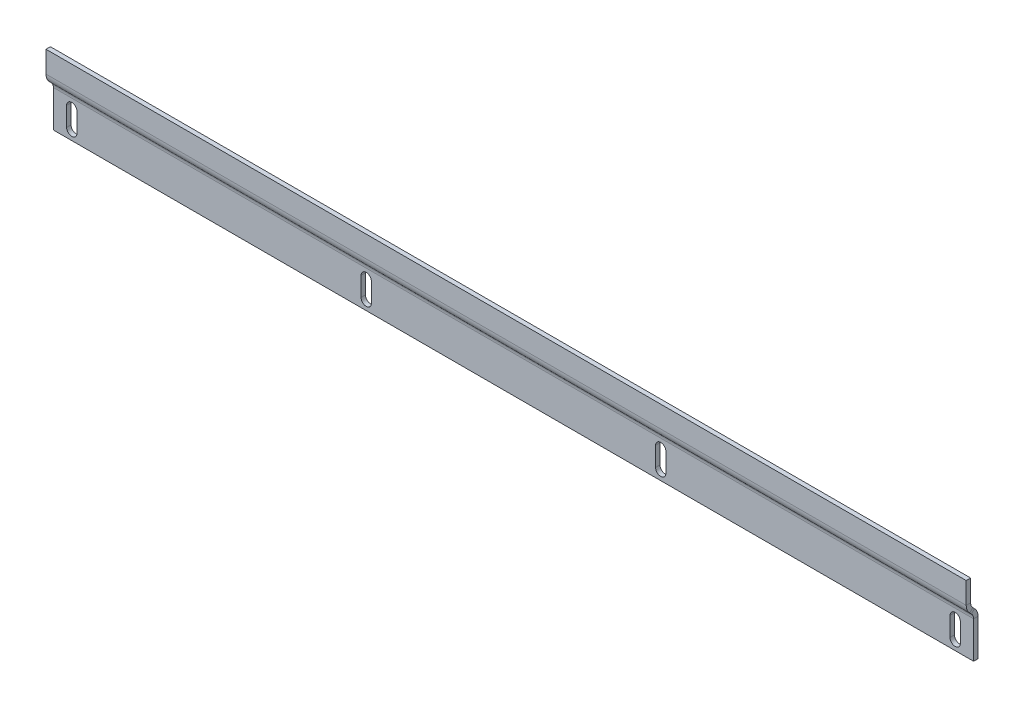
ISO-10303-21;
HEADER;
FILE_DESCRIPTION(('STEP AP214'),'2;1');
FILE_NAME('part.step','',(''),(''),'','','');
FILE_SCHEMA(('AUTOMOTIVE_DESIGN { 1 0 10303 214 1 1 1 1 }'));
ENDSEC;
DATA;
#1=APPLICATION_CONTEXT('core data for automotive mechanical design processes');
#2=APPLICATION_PROTOCOL_DEFINITION('international standard','automotive_design',2000,#1);
#3=PRODUCT_CONTEXT('',#1,'mechanical');
#4=PRODUCT('Part','Part','',(#3));
#5=PRODUCT_RELATED_PRODUCT_CATEGORY('part','',(#4));
#6=PRODUCT_DEFINITION_FORMATION('','',#4);
#7=PRODUCT_DEFINITION_CONTEXT('part definition',#1,'design');
#8=PRODUCT_DEFINITION('design','',#6,#7);
#9=PRODUCT_DEFINITION_SHAPE('','',#8);
#10=(LENGTH_UNIT() NAMED_UNIT(*) SI_UNIT(.MILLI.,.METRE.));
#11=(NAMED_UNIT(*) PLANE_ANGLE_UNIT() SI_UNIT($,.RADIAN.));
#12=(NAMED_UNIT(*) SI_UNIT($,.STERADIAN.) SOLID_ANGLE_UNIT());
#13=UNCERTAINTY_MEASURE_WITH_UNIT(LENGTH_MEASURE(1.E-05),#10,'distance_accuracy_value','');
#14=(GEOMETRIC_REPRESENTATION_CONTEXT(3) GLOBAL_UNCERTAINTY_ASSIGNED_CONTEXT((#13)) GLOBAL_UNIT_ASSIGNED_CONTEXT((#10,
#11,#12)) REPRESENTATION_CONTEXT('',''));
#15=CARTESIAN_POINT('',(0.,0.,0.));
#16=DIRECTION('',(0.,0.,1.));
#17=DIRECTION('',(1.,0.,0.));
#18=AXIS2_PLACEMENT_3D('',#15,#16,#17);
#19=CARTESIAN_POINT('',(300.,-6.00000000000003,0.));
#20=DIRECTION('',(0.,0.,-0.999999999999999));
#21=DIRECTION('',(-1.,0.,0.));
#22=AXIS2_PLACEMENT_3D('',#19,#20,#21);
#23=CYLINDRICAL_SURFACE('',#22,3.5);
#24=DIRECTION('',(0.,0.,0.999999999999999));
#25=VECTOR('',#24,1.);
#26=CARTESIAN_POINT('',(296.5,-6.00000000000006,0.));
#27=LINE('',#26,#25);
#28=CARTESIAN_POINT('',(296.5,-6.00000000000005,-3.));
#29=VERTEX_POINT('',#28);
#30=CARTESIAN_POINT('',(296.5,-6.00000000000006,0.));
#31=VERTEX_POINT('',#30);
#32=EDGE_CURVE('E11',#29,#31,#27,.T.);
#33=ORIENTED_EDGE('',*,*,#32,.F.);
#34=CARTESIAN_POINT('',(300.,-6.00000000000003,-2.99999999999999));
#35=DIRECTION('',(0.,0.,0.999999999999999));
#36=DIRECTION('',(1.,0.,0.));
#37=AXIS2_PLACEMENT_3D('',#34,#35,#36);
#38=CIRCLE('',#37,3.5);
#39=CARTESIAN_POINT('',(303.5,-6.00000000000002,-3.));
#40=VERTEX_POINT('',#39);
#41=EDGE_CURVE('E173',#40,#29,#38,.T.);
#42=ORIENTED_EDGE('',*,*,#41,.F.);
#43=DIRECTION('',(0.,0.,0.999999999999999));
#44=VECTOR('',#43,1.);
#45=CARTESIAN_POINT('',(303.5,-6.00000000000003,0.));
#46=LINE('',#45,#44);
#47=CARTESIAN_POINT('',(303.5,-6.00000000000003,0.));
#48=VERTEX_POINT('',#47);
#49=EDGE_CURVE('E53',#40,#48,#46,.T.);
#50=ORIENTED_EDGE('',*,*,#49,.T.);
#51=CARTESIAN_POINT('',(300.,-6.00000000000003,0.));
#52=DIRECTION('',(0.,0.,0.999999999999999));
#53=DIRECTION('',(1.,0.,0.));
#54=AXIS2_PLACEMENT_3D('',#51,#52,#53);
#55=CIRCLE('',#54,3.5);
#56=EDGE_CURVE('E270',#48,#31,#55,.T.);
#57=ORIENTED_EDGE('',*,*,#56,.T.);
#58=EDGE_LOOP('',(#33,#42,#50,#57));
#59=FACE_BOUND('',#58,.T.);
#60=ADVANCED_FACE('F43',(#59),#23,.F.);
#61=CARTESIAN_POINT('',(303.5,-19.,0.));
#62=DIRECTION('',(-1.,0.,0.));
#63=DIRECTION('',(0.,1.,0.));
#64=AXIS2_PLACEMENT_3D('',#61,#62,#63);
#65=PLANE('',#64);
#66=ORIENTED_EDGE('',*,*,#49,.F.);
#67=DIRECTION('',(0.,0.999999999999999,0.));
#68=VECTOR('',#67,1.);
#69=CARTESIAN_POINT('',(303.5,0.,-3.));
#70=LINE('',#69,#68);
#71=CARTESIAN_POINT('',(303.5,-19.,-3.));
#72=VERTEX_POINT('',#71);
#73=EDGE_CURVE('E190',#72,#40,#70,.T.);
#74=ORIENTED_EDGE('',*,*,#73,.F.);
#75=DIRECTION('',(0.,0.,0.999999999999999));
#76=VECTOR('',#75,1.);
#77=CARTESIAN_POINT('',(303.5,-19.,0.));
#78=LINE('',#77,#76);
#79=CARTESIAN_POINT('',(303.5,-19.,0.));
#80=VERTEX_POINT('',#79);
#81=EDGE_CURVE('E165',#72,#80,#78,.T.);
#82=ORIENTED_EDGE('',*,*,#81,.T.);
#83=DIRECTION('',(0.,1.,0.));
#84=VECTOR('',#83,1.);
#85=CARTESIAN_POINT('',(303.5,-19.,0.));
#86=LINE('',#85,#84);
#87=EDGE_CURVE('E278',#80,#48,#86,.T.);
#88=ORIENTED_EDGE('',*,*,#87,.T.);
#89=EDGE_LOOP('',(#66,#74,#82,#88));
#90=FACE_BOUND('',#89,.T.);
#91=ADVANCED_FACE('F281',(#90),#65,.T.);
#92=CARTESIAN_POINT('',(300.,-19.,0.));
#93=DIRECTION('',(0.,0.,-0.999999999999999));
#94=DIRECTION('',(-1.,0.,0.));
#95=AXIS2_PLACEMENT_3D('',#92,#93,#94);
#96=CYLINDRICAL_SURFACE('',#95,3.5);
#97=ORIENTED_EDGE('',*,*,#81,.F.);
#98=CARTESIAN_POINT('',(300.,-19.,-3.00000000000001));
#99=DIRECTION('',(0.,0.,0.999999999999999));
#100=DIRECTION('',(1.,0.,0.));
#101=AXIS2_PLACEMENT_3D('',#98,#99,#100);
#102=CIRCLE('',#101,3.5);
#103=CARTESIAN_POINT('',(296.5,-19.,-3.));
#104=VERTEX_POINT('',#103);
#105=EDGE_CURVE('E171',#104,#72,#102,.T.);
#106=ORIENTED_EDGE('',*,*,#105,.F.);
#107=DIRECTION('',(0.,0.,0.999999999999999));
#108=VECTOR('',#107,1.);
#109=CARTESIAN_POINT('',(296.5,-19.0000000000001,0.));
#110=LINE('',#109,#108);
#111=CARTESIAN_POINT('',(296.5,-19.0000000000001,0.));
#112=VERTEX_POINT('',#111);
#113=EDGE_CURVE('E47',#104,#112,#110,.T.);
#114=ORIENTED_EDGE('',*,*,#113,.T.);
#115=CARTESIAN_POINT('',(300.,-19.,0.));
#116=DIRECTION('',(0.,0.,0.999999999999999));
#117=DIRECTION('',(1.,0.,0.));
#118=AXIS2_PLACEMENT_3D('',#115,#116,#117);
#119=CIRCLE('',#118,3.5);
#120=EDGE_CURVE('E553',#112,#80,#119,.T.);
#121=ORIENTED_EDGE('',*,*,#120,.T.);
#122=EDGE_LOOP('',(#97,#106,#114,#121));
#123=FACE_BOUND('',#122,.T.);
#124=ADVANCED_FACE('F176',(#123),#96,.F.);
#125=CARTESIAN_POINT('',(100.,-6.00000000000003,0.));
#126=DIRECTION('',(0.,0.,-0.999999999999999));
#127=DIRECTION('',(-1.,0.,0.));
#128=AXIS2_PLACEMENT_3D('',#125,#126,#127);
#129=CYLINDRICAL_SURFACE('',#128,3.5);
#130=DIRECTION('',(0.,0.,0.999999999999999));
#131=VECTOR('',#130,1.);
#132=CARTESIAN_POINT('',(96.5000000000001,-6.00000000000006,0.));
#133=LINE('',#132,#131);
#134=CARTESIAN_POINT('',(96.5,-6.00000000000005,-3.));
#135=VERTEX_POINT('',#134);
#136=CARTESIAN_POINT('',(96.5000000000001,-6.00000000000006,0.));
#137=VERTEX_POINT('',#136);
#138=EDGE_CURVE('E166',#135,#137,#133,.T.);
#139=ORIENTED_EDGE('',*,*,#138,.F.);
#140=CARTESIAN_POINT('',(100.,-6.00000000000003,-2.99999999999998));
#141=DIRECTION('',(0.,0.,0.999999999999999));
#142=DIRECTION('',(1.,0.,0.));
#143=AXIS2_PLACEMENT_3D('',#140,#141,#142);
#144=CIRCLE('',#143,3.5);
#145=CARTESIAN_POINT('',(103.5,-6.00000000000002,-3.));
#146=VERTEX_POINT('',#145);
#147=EDGE_CURVE('E184',#146,#135,#144,.T.);
#148=ORIENTED_EDGE('',*,*,#147,.F.);
#149=DIRECTION('',(0.,0.,0.999999999999999));
#150=VECTOR('',#149,1.);
#151=CARTESIAN_POINT('',(103.5,-6.00000000000003,0.));
#152=LINE('',#151,#150);
#153=CARTESIAN_POINT('',(103.5,-6.00000000000003,0.));
#154=VERTEX_POINT('',#153);
#155=EDGE_CURVE('E258',#146,#154,#152,.T.);
#156=ORIENTED_EDGE('',*,*,#155,.T.);
#157=CARTESIAN_POINT('',(100.,-6.00000000000003,0.));
#158=DIRECTION('',(0.,0.,0.999999999999999));
#159=DIRECTION('',(1.,0.,0.));
#160=AXIS2_PLACEMENT_3D('',#157,#158,#159);
#161=CIRCLE('',#160,3.5);
#162=EDGE_CURVE('E547',#154,#137,#161,.T.);
#163=ORIENTED_EDGE('',*,*,#162,.T.);
#164=EDGE_LOOP('',(#139,#148,#156,#163));
#165=FACE_BOUND('',#164,.T.);
#166=ADVANCED_FACE('F580',(#165),#129,.F.);
#167=CARTESIAN_POINT('',(103.5,-19.,0.));
#168=DIRECTION('',(-1.,0.,0.));
#169=DIRECTION('',(0.,1.,0.));
#170=AXIS2_PLACEMENT_3D('',#167,#168,#169);
#171=PLANE('',#170);
#172=ORIENTED_EDGE('',*,*,#155,.F.);
#173=DIRECTION('',(0.,0.999999999999999,0.));
#174=VECTOR('',#173,1.);
#175=CARTESIAN_POINT('',(103.5,0.,-3.));
#176=LINE('',#175,#174);
#177=CARTESIAN_POINT('',(103.5,-19.,-3.));
#178=VERTEX_POINT('',#177);
#179=EDGE_CURVE('E179',#178,#146,#176,.T.);
#180=ORIENTED_EDGE('',*,*,#179,.F.);
#181=DIRECTION('',(0.,0.,0.999999999999999));
#182=VECTOR('',#181,1.);
#183=CARTESIAN_POINT('',(103.5,-19.,0.));
#184=LINE('',#183,#182);
#185=CARTESIAN_POINT('',(103.5,-19.,0.));
#186=VERTEX_POINT('',#185);
#187=EDGE_CURVE('E255',#178,#186,#184,.T.);
#188=ORIENTED_EDGE('',*,*,#187,.T.);
#189=DIRECTION('',(0.,1.,0.));
#190=VECTOR('',#189,1.);
#191=CARTESIAN_POINT('',(103.5,-19.,0.));
#192=LINE('',#191,#190);
#193=EDGE_CURVE('E439',#186,#154,#192,.T.);
#194=ORIENTED_EDGE('',*,*,#193,.T.);
#195=EDGE_LOOP('',(#172,#180,#188,#194));
#196=FACE_BOUND('',#195,.T.);
#197=ADVANCED_FACE('F437',(#196),#171,.T.);
#198=CARTESIAN_POINT('',(100.,-19.,0.));
#199=DIRECTION('',(0.,0.,-0.999999999999999));
#200=DIRECTION('',(-1.,0.,0.));
#201=AXIS2_PLACEMENT_3D('',#198,#199,#200);
#202=CYLINDRICAL_SURFACE('',#201,3.5);
#203=ORIENTED_EDGE('',*,*,#187,.F.);
#204=CARTESIAN_POINT('',(100.,-19.,-3.00000000000001));
#205=DIRECTION('',(0.,0.,0.999999999999999));
#206=DIRECTION('',(1.,0.,0.));
#207=AXIS2_PLACEMENT_3D('',#204,#205,#206);
#208=CIRCLE('',#207,3.5);
#209=CARTESIAN_POINT('',(96.5,-19.,-3.));
#210=VERTEX_POINT('',#209);
#211=EDGE_CURVE('E357',#210,#178,#208,.T.);
#212=ORIENTED_EDGE('',*,*,#211,.F.);
#213=DIRECTION('',(0.,0.,0.999999999999999));
#214=VECTOR('',#213,1.);
#215=CARTESIAN_POINT('',(96.5,-19.,0.));
#216=LINE('',#215,#214);
#217=CARTESIAN_POINT('',(96.5,-19.,0.));
#218=VERTEX_POINT('',#217);
#219=EDGE_CURVE('E252',#210,#218,#216,.T.);
#220=ORIENTED_EDGE('',*,*,#219,.T.);
#221=CARTESIAN_POINT('',(100.,-19.,0.));
#222=DIRECTION('',(0.,0.,0.999999999999999));
#223=DIRECTION('',(1.,0.,0.));
#224=AXIS2_PLACEMENT_3D('',#221,#222,#223);
#225=CIRCLE('',#224,3.5);
#226=EDGE_CURVE('E433',#218,#186,#225,.T.);
#227=ORIENTED_EDGE('',*,*,#226,.T.);
#228=EDGE_LOOP('',(#203,#212,#220,#227));
#229=FACE_BOUND('',#228,.T.);
#230=ADVANCED_FACE('F428',(#229),#202,.F.);
#231=CARTESIAN_POINT('',(-303.5,-19.,0.));
#232=DIRECTION('',(1.,0.,0.));
#233=DIRECTION('',(0.,-1.,0.));
#234=AXIS2_PLACEMENT_3D('',#231,#232,#233);
#235=PLANE('',#234);
#236=DIRECTION('',(0.,0.,0.999999999999999));
#237=VECTOR('',#236,1.);
#238=CARTESIAN_POINT('',(-303.5,-19.,0.));
#239=LINE('',#238,#237);
#240=CARTESIAN_POINT('',(-303.499999999999,-19.,-3.));
#241=VERTEX_POINT('',#240);
#242=CARTESIAN_POINT('',(-303.5,-19.,0.));
#243=VERTEX_POINT('',#242);
#244=EDGE_CURVE('E249',#241,#243,#239,.T.);
#245=ORIENTED_EDGE('',*,*,#244,.F.);
#246=DIRECTION('',(0.,0.999999999999999,0.));
#247=VECTOR('',#246,1.);
#248=CARTESIAN_POINT('',(-303.499999999999,0.,-3.));
#249=LINE('',#248,#247);
#250=CARTESIAN_POINT('',(-303.499999999999,-5.99999999999999,-3.));
#251=VERTEX_POINT('',#250);
#252=EDGE_CURVE('E406',#251,#241,#249,.F.);
#253=ORIENTED_EDGE('',*,*,#252,.F.);
#254=DIRECTION('',(0.,0.,0.999999999999999));
#255=VECTOR('',#254,1.);
#256=CARTESIAN_POINT('',(-303.5,-6.00000000000001,0.));
#257=LINE('',#256,#255);
#258=CARTESIAN_POINT('',(-303.5,-6.00000000000001,0.));
#259=VERTEX_POINT('',#258);
#260=EDGE_CURVE('E246',#251,#259,#257,.T.);
#261=ORIENTED_EDGE('',*,*,#260,.T.);
#262=DIRECTION('',(0.,-1.,0.));
#263=VECTOR('',#262,1.);
#264=CARTESIAN_POINT('',(-303.5,-19.,0.));
#265=LINE('',#264,#263);
#266=EDGE_CURVE('E517',#259,#243,#265,.T.);
#267=ORIENTED_EDGE('',*,*,#266,.T.);
#268=EDGE_LOOP('',(#245,#253,#261,#267));
#269=FACE_BOUND('',#268,.T.);
#270=ADVANCED_FACE('F683',(#269),#235,.T.);
#271=CARTESIAN_POINT('',(-300.,-6.00000000000003,0.));
#272=DIRECTION('',(0.,0.,-0.999999999999999));
#273=DIRECTION('',(-1.,0.,0.));
#274=AXIS2_PLACEMENT_3D('',#271,#272,#273);
#275=CYLINDRICAL_SURFACE('',#274,3.5);
#276=ORIENTED_EDGE('',*,*,#260,.F.);
#277=CARTESIAN_POINT('',(-300.,-6.00000000000003,-3.));
#278=DIRECTION('',(0.,0.,0.999999999999999));
#279=DIRECTION('',(1.,0.,0.));
#280=AXIS2_PLACEMENT_3D('',#277,#278,#279);
#281=CIRCLE('',#280,3.5);
#282=CARTESIAN_POINT('',(-296.499999999999,-5.99999999999999,-3.));
#283=VERTEX_POINT('',#282);
#284=EDGE_CURVE('E338',#283,#251,#281,.T.);
#285=ORIENTED_EDGE('',*,*,#284,.F.);
#286=DIRECTION('',(0.,0.,0.999999999999999));
#287=VECTOR('',#286,1.);
#288=CARTESIAN_POINT('',(-296.5,-6.00000000000001,0.));
#289=LINE('',#288,#287);
#290=CARTESIAN_POINT('',(-296.5,-6.00000000000001,0.));
#291=VERTEX_POINT('',#290);
#292=EDGE_CURVE('E243',#283,#291,#289,.T.);
#293=ORIENTED_EDGE('',*,*,#292,.T.);
#294=CARTESIAN_POINT('',(-300.,-6.00000000000003,0.));
#295=DIRECTION('',(0.,0.,0.999999999999999));
#296=DIRECTION('',(1.,0.,0.));
#297=AXIS2_PLACEMENT_3D('',#294,#295,#296);
#298=CIRCLE('',#297,3.5);
#299=EDGE_CURVE('E521',#291,#259,#298,.T.);
#300=ORIENTED_EDGE('',*,*,#299,.T.);
#301=EDGE_LOOP('',(#276,#285,#293,#300));
#302=FACE_BOUND('',#301,.T.);
#303=ADVANCED_FACE('F690',(#302),#275,.F.);
#304=CARTESIAN_POINT('',(-296.5,-19.,0.));
#305=DIRECTION('',(-1.,0.,0.));
#306=DIRECTION('',(0.,1.,0.));
#307=AXIS2_PLACEMENT_3D('',#304,#305,#306);
#308=PLANE('',#307);
#309=ORIENTED_EDGE('',*,*,#292,.F.);
#310=DIRECTION('',(0.,0.999999999999999,0.));
#311=VECTOR('',#310,1.);
#312=CARTESIAN_POINT('',(-296.499999999999,0.,-3.));
#313=LINE('',#312,#311);
#314=CARTESIAN_POINT('',(-296.499999999999,-19.,-3.));
#315=VERTEX_POINT('',#314);
#316=EDGE_CURVE('E391',#315,#283,#313,.T.);
#317=ORIENTED_EDGE('',*,*,#316,.F.);
#318=DIRECTION('',(0.,0.,0.999999999999999));
#319=VECTOR('',#318,1.);
#320=CARTESIAN_POINT('',(-296.5,-19.,0.));
#321=LINE('',#320,#319);
#322=CARTESIAN_POINT('',(-296.5,-19.,0.));
#323=VERTEX_POINT('',#322);
#324=EDGE_CURVE('E240',#315,#323,#321,.T.);
#325=ORIENTED_EDGE('',*,*,#324,.T.);
#326=DIRECTION('',(0.,1.,0.));
#327=VECTOR('',#326,1.);
#328=CARTESIAN_POINT('',(-296.5,-19.,0.));
#329=LINE('',#328,#327);
#330=EDGE_CURVE('E509',#323,#291,#329,.T.);
#331=ORIENTED_EDGE('',*,*,#330,.T.);
#332=EDGE_LOOP('',(#309,#317,#325,#331));
#333=FACE_BOUND('',#332,.T.);
#334=ADVANCED_FACE('F694',(#333),#308,.T.);
#335=CARTESIAN_POINT('',(-103.5,-19.,0.));
#336=DIRECTION('',(1.,0.,0.));
#337=DIRECTION('',(0.,-1.,0.));
#338=AXIS2_PLACEMENT_3D('',#335,#336,#337);
#339=PLANE('',#338);
#340=DIRECTION('',(0.,0.,0.999999999999999));
#341=VECTOR('',#340,1.);
#342=CARTESIAN_POINT('',(-103.5,-19.,0.));
#343=LINE('',#342,#341);
#344=CARTESIAN_POINT('',(-103.5,-19.,-3.));
#345=VERTEX_POINT('',#344);
#346=CARTESIAN_POINT('',(-103.5,-19.,0.));
#347=VERTEX_POINT('',#346);
#348=EDGE_CURVE('E237',#345,#347,#343,.T.);
#349=ORIENTED_EDGE('',*,*,#348,.F.);
#350=DIRECTION('',(0.,0.999999999999999,0.));
#351=VECTOR('',#350,1.);
#352=CARTESIAN_POINT('',(-103.5,0.,-3.));
#353=LINE('',#352,#351);
#354=CARTESIAN_POINT('',(-103.5,-6.00000000000002,-3.));
#355=VERTEX_POINT('',#354);
#356=EDGE_CURVE('E392',#355,#345,#353,.F.);
#357=ORIENTED_EDGE('',*,*,#356,.F.);
#358=DIRECTION('',(0.,0.,0.999999999999999));
#359=VECTOR('',#358,1.);
#360=CARTESIAN_POINT('',(-103.5,-6.00000000000003,0.));
#361=LINE('',#360,#359);
#362=CARTESIAN_POINT('',(-103.5,-6.00000000000003,0.));
#363=VERTEX_POINT('',#362);
#364=EDGE_CURVE('E234',#355,#363,#361,.T.);
#365=ORIENTED_EDGE('',*,*,#364,.T.);
#366=DIRECTION('',(0.,-1.,0.));
#367=VECTOR('',#366,1.);
#368=CARTESIAN_POINT('',(-103.5,-19.,0.));
#369=LINE('',#368,#367);
#370=EDGE_CURVE('E501',#363,#347,#369,.T.);
#371=ORIENTED_EDGE('',*,*,#370,.T.);
#372=EDGE_LOOP('',(#349,#357,#365,#371));
#373=FACE_BOUND('',#372,.T.);
#374=ADVANCED_FACE('F698',(#373),#339,.T.);
#375=CARTESIAN_POINT('',(-99.9999999999998,-6.00000000000003,0.));
#376=DIRECTION('',(0.,0.,-0.999999999999999));
#377=DIRECTION('',(-1.,0.,0.));
#378=AXIS2_PLACEMENT_3D('',#375,#376,#377);
#379=CYLINDRICAL_SURFACE('',#378,3.5);
#380=ORIENTED_EDGE('',*,*,#364,.F.);
#381=CARTESIAN_POINT('',(-99.9999999999998,-6.00000000000003,-3.00000000000001));
#382=DIRECTION('',(0.,0.,0.999999999999999));
#383=DIRECTION('',(1.,0.,0.));
#384=AXIS2_PLACEMENT_3D('',#381,#382,#383);
#385=CIRCLE('',#384,3.5);
#386=CARTESIAN_POINT('',(-96.4999999999998,-5.99999999999999,-3.));
#387=VERTEX_POINT('',#386);
#388=EDGE_CURVE('E387',#387,#355,#385,.T.);
#389=ORIENTED_EDGE('',*,*,#388,.F.);
#390=DIRECTION('',(0.,0.,0.999999999999999));
#391=VECTOR('',#390,1.);
#392=CARTESIAN_POINT('',(-96.4999999999998,-6.00000000000001,0.));
#393=LINE('',#392,#391);
#394=CARTESIAN_POINT('',(-96.4999999999998,-6.00000000000001,0.));
#395=VERTEX_POINT('',#394);
#396=EDGE_CURVE('E231',#387,#395,#393,.T.);
#397=ORIENTED_EDGE('',*,*,#396,.T.);
#398=CARTESIAN_POINT('',(-99.9999999999998,-6.00000000000003,0.));
#399=DIRECTION('',(0.,0.,0.999999999999999));
#400=DIRECTION('',(1.,0.,0.));
#401=AXIS2_PLACEMENT_3D('',#398,#399,#400);
#402=CIRCLE('',#401,3.5);
#403=EDGE_CURVE('E505',#395,#363,#402,.T.);
#404=ORIENTED_EDGE('',*,*,#403,.T.);
#405=EDGE_LOOP('',(#380,#389,#397,#404));
#406=FACE_BOUND('',#405,.T.);
#407=ADVANCED_FACE('F661',(#406),#379,.F.);
#408=CARTESIAN_POINT('',(-96.4999999999999,-19.,0.));
#409=DIRECTION('',(-1.,0.,0.));
#410=DIRECTION('',(0.,1.,0.));
#411=AXIS2_PLACEMENT_3D('',#408,#409,#410);
#412=PLANE('',#411);
#413=ORIENTED_EDGE('',*,*,#396,.F.);
#414=DIRECTION('',(0.,0.999999999999999,0.));
#415=VECTOR('',#414,1.);
#416=CARTESIAN_POINT('',(-96.4999999999998,0.,-3.));
#417=LINE('',#416,#415);
#418=CARTESIAN_POINT('',(-96.4999999999998,-19.,-3.));
#419=VERTEX_POINT('',#418);
#420=EDGE_CURVE('E348',#419,#387,#417,.T.);
#421=ORIENTED_EDGE('',*,*,#420,.F.);
#422=DIRECTION('',(0.,0.,0.999999999999999));
#423=VECTOR('',#422,1.);
#424=CARTESIAN_POINT('',(-96.4999999999999,-19.,0.));
#425=LINE('',#424,#423);
#426=CARTESIAN_POINT('',(-96.4999999999999,-19.,0.));
#427=VERTEX_POINT('',#426);
#428=EDGE_CURVE('E227',#419,#427,#425,.T.);
#429=ORIENTED_EDGE('',*,*,#428,.T.);
#430=DIRECTION('',(0.,1.,0.));
#431=VECTOR('',#430,1.);
#432=CARTESIAN_POINT('',(-96.4999999999999,-19.,0.));
#433=LINE('',#432,#431);
#434=EDGE_CURVE('E493',#427,#395,#433,.T.);
#435=ORIENTED_EDGE('',*,*,#434,.T.);
#436=EDGE_LOOP('',(#413,#421,#429,#435));
#437=FACE_BOUND('',#436,.T.);
#438=ADVANCED_FACE('F654',(#437),#412,.T.);
#439=CARTESIAN_POINT('',(-312.5,25.,5.));
#440=DIRECTION('',(0.,-1.,0.));
#441=DIRECTION('',(-1.,0.,0.));
#442=AXIS2_PLACEMENT_3D('',#439,#440,#441);
#443=PLANE('',#442);
#444=DIRECTION('',(0.,0.,0.999999999999999));
#445=VECTOR('',#444,1.);
#446=CARTESIAN_POINT('',(312.5,25.,5.00000000000002));
#447=LINE('',#446,#445);
#448=CARTESIAN_POINT('',(312.5,25.,2.00000000000001));
#449=VERTEX_POINT('',#448);
#450=CARTESIAN_POINT('',(312.5,25.,5.00000000000002));
#451=VERTEX_POINT('',#450);
#452=EDGE_CURVE('E225',#449,#451,#447,.T.);
#453=ORIENTED_EDGE('',*,*,#452,.F.);
#454=DIRECTION('',(-1.,0.,0.));
#455=VECTOR('',#454,1.);
#456=CARTESIAN_POINT('',(0.,25.,2.00000000000001));
#457=LINE('',#456,#455);
#458=CARTESIAN_POINT('',(-312.5,24.9999999999999,2.00000000000001));
#459=VERTEX_POINT('',#458);
#460=EDGE_CURVE('E344',#449,#459,#457,.T.);
#461=ORIENTED_EDGE('',*,*,#460,.T.);
#462=DIRECTION('',(0.,0.,0.999999999999999));
#463=VECTOR('',#462,1.);
#464=CARTESIAN_POINT('',(-312.5,25.,5.));
#465=LINE('',#464,#463);
#466=CARTESIAN_POINT('',(-312.5,25.,5.));
#467=VERTEX_POINT('',#466);
#468=EDGE_CURVE('E61',#459,#467,#465,.T.);
#469=ORIENTED_EDGE('',*,*,#468,.T.);
#470=DIRECTION('',(-1.,0.,0.));
#471=VECTOR('',#470,1.);
#472=CARTESIAN_POINT('',(-312.5,25.,5.));
#473=LINE('',#472,#471);
#474=EDGE_CURVE('E307',#451,#467,#473,.T.);
#475=ORIENTED_EDGE('',*,*,#474,.F.);
#476=EDGE_LOOP('',(#453,#461,#469,#475));
#477=FACE_BOUND('',#476,.T.);
#478=ADVANCED_FACE('F651',(#477),#443,.F.);
#479=CARTESIAN_POINT('',(-312.5,-26.5116913143319,5.00000000000003));
#480=DIRECTION('',(1.,0.,0.));
#481=DIRECTION('',(0.,-1.,0.));
#482=AXIS2_PLACEMENT_3D('',#479,#480,#481);
#483=PLANE('',#482);
#484=ORIENTED_EDGE('',*,*,#468,.F.);
#485=DIRECTION('',(0.,0.999999999999999,0.));
#486=VECTOR('',#485,1.);
#487=CARTESIAN_POINT('',(-312.5,-1.51169131433188,2.00000000000001));
#488=LINE('',#487,#486);
#489=CARTESIAN_POINT('',(-312.499999999999,10.3847763108503,2.00000000000001));
#490=VERTEX_POINT('',#489);
#491=EDGE_CURVE('E322',#459,#490,#488,.F.);
#492=ORIENTED_EDGE('',*,*,#491,.T.);
#493=DIRECTION('',(0.,0.,1.));
#494=VECTOR('',#493,1.);
#495=CARTESIAN_POINT('',(-312.5,10.3847763108503,5.00000000000002));
#496=LINE('',#495,#494);
#497=CARTESIAN_POINT('',(-312.5,10.3847763108503,5.00000000000002));
#498=VERTEX_POINT('',#497);
#499=EDGE_CURVE('E221',#490,#498,#496,.T.);
#500=ORIENTED_EDGE('',*,*,#499,.T.);
#501=DIRECTION('',(0.,-1.,0.));
#502=VECTOR('',#501,1.);
#503=CARTESIAN_POINT('',(-312.5,-26.5116913143319,5.00000000000003));
#504=LINE('',#503,#502);
#505=EDGE_CURVE('E295',#467,#498,#504,.T.);
#506=ORIENTED_EDGE('',*,*,#505,.F.);
#507=EDGE_LOOP('',(#484,#492,#500,#506));
#508=FACE_BOUND('',#507,.T.);
#509=ADVANCED_FACE('F653',(#508),#483,.F.);
#510=CARTESIAN_POINT('',(-312.5,10.3847763108502,-2.99999999999997));
#511=DIRECTION('',(-1.,0.,0.));
#512=DIRECTION('',(0.,0.,1.));
#513=AXIS2_PLACEMENT_3D('',#510,#511,#512);
#514=PLANE('',#513);
#515=ORIENTED_EDGE('',*,*,#499,.F.);
#516=CARTESIAN_POINT('',(-312.5,10.3847763108502,-2.99999999999998));
#517=DIRECTION('',(1.,0.,0.));
#518=DIRECTION('',(0.,0.,-1.));
#519=AXIS2_PLACEMENT_3D('',#516,#517,#518);
#520=CIRCLE('',#519,5.);
#521=CARTESIAN_POINT('',(-312.5,6.84924240491751,0.535533905932757));
#522=VERTEX_POINT('',#521);
#523=EDGE_CURVE('E343',#522,#490,#520,.F.);
#524=ORIENTED_EDGE('',*,*,#523,.F.);
#525=DIRECTION('',(0.,-0.707106781186549,0.707106781186546));
#526=VECTOR('',#525,1.);
#527=CARTESIAN_POINT('',(-312.5,4.72792206135787,2.65685424949239));
#528=LINE('',#527,#526);
#529=CARTESIAN_POINT('',(-312.5,4.72792206135787,2.65685424949239));
#530=VERTEX_POINT('',#529);
#531=EDGE_CURVE('E218',#522,#530,#528,.T.);
#532=ORIENTED_EDGE('',*,*,#531,.T.);
#533=CARTESIAN_POINT('',(-312.5,10.3847763108502,-2.99999999999997));
#534=DIRECTION('',(1.,0.,0.));
#535=DIRECTION('',(0.,0.,-0.999999999999999));
#536=AXIS2_PLACEMENT_3D('',#533,#534,#535);
#537=CIRCLE('',#536,8.);
#538=EDGE_CURVE('E230',#530,#498,#537,.F.);
#539=ORIENTED_EDGE('',*,*,#538,.T.);
#540=EDGE_LOOP('',(#515,#524,#532,#539));
#541=FACE_BOUND('',#540,.T.);
#542=ADVANCED_FACE('F468',(#541),#514,.T.);
#543=CARTESIAN_POINT('',(-312.5,-17.7519780109846,-19.8230458228501));
#544=DIRECTION('',(1.,0.,0.));
#545=DIRECTION('',(0.,-0.707106781186546,-0.707106781186548));
#546=AXIS2_PLACEMENT_3D('',#543,#544,#545);
#547=PLANE('',#546);
#548=ORIENTED_EDGE('',*,*,#531,.F.);
#549=DIRECTION('',(0.,0.707106781186546,0.707106781186548));
#550=VECTOR('',#549,1.);
#551=CARTESIAN_POINT('',(-312.5,2.0470118622387,-4.26669663674607));
#552=LINE('',#551,#550);
#553=CARTESIAN_POINT('',(-312.5,5.65685424949236,-0.656854249492387));
#554=VERTEX_POINT('',#553);
#555=EDGE_CURVE('E327',#522,#554,#552,.F.);
#556=ORIENTED_EDGE('',*,*,#555,.T.);
#557=DIRECTION('',(0.,-0.707106781186553,0.707106781186542));
#558=VECTOR('',#557,1.);
#559=CARTESIAN_POINT('',(-312.5,3.53553390593273,1.46446609406725));
#560=LINE('',#559,#558);
#561=CARTESIAN_POINT('',(-312.5,3.53553390593273,1.46446609406725));
#562=VERTEX_POINT('',#561);
#563=EDGE_CURVE('E215',#554,#562,#560,.T.);
#564=ORIENTED_EDGE('',*,*,#563,.T.);
#565=DIRECTION('',(0.,-0.707106781186546,-0.707106781186548));
#566=VECTOR('',#565,1.);
#567=CARTESIAN_POINT('',(-312.5,-17.7519780109846,-19.8230458228501));
#568=LINE('',#567,#566);
#569=EDGE_CURVE('E479',#530,#562,#568,.T.);
#570=ORIENTED_EDGE('',*,*,#569,.F.);
#571=EDGE_LOOP('',(#548,#556,#564,#570));
#572=FACE_BOUND('',#571,.T.);
#573=ADVANCED_FACE('F614',(#572),#547,.F.);
#574=CARTESIAN_POINT('',(-312.5,0.,4.99999999999998));
#575=DIRECTION('',(-1.,0.,0.));
#576=DIRECTION('',(0.,0.,1.));
#577=AXIS2_PLACEMENT_3D('',#574,#575,#576);
#578=PLANE('',#577);
#579=ORIENTED_EDGE('',*,*,#563,.F.);
#580=CARTESIAN_POINT('',(-312.5,0.,4.99999999999998));
#581=DIRECTION('',(1.,0.,0.));
#582=DIRECTION('',(0.,0.,-1.));
#583=AXIS2_PLACEMENT_3D('',#580,#581,#582);
#584=CIRCLE('',#583,8.);
#585=CARTESIAN_POINT('',(-312.5,0.,-3.));
#586=VERTEX_POINT('',#585);
#587=EDGE_CURVE('E352',#586,#554,#584,.T.);
#588=ORIENTED_EDGE('',*,*,#587,.F.);
#589=DIRECTION('',(0.,0.,0.999999999999999));
#590=VECTOR('',#589,1.);
#591=CARTESIAN_POINT('',(-312.5,0.,0.));
#592=LINE('',#591,#590);
#593=CARTESIAN_POINT('',(-312.5,0.,0.));
#594=VERTEX_POINT('',#593);
#595=EDGE_CURVE('E212',#586,#594,#592,.T.);
#596=ORIENTED_EDGE('',*,*,#595,.T.);
#597=CARTESIAN_POINT('',(-312.5,0.,4.99999999999998));
#598=DIRECTION('',(1.,0.,0.));
#599=DIRECTION('',(0.,0.,-0.999999999999999));
#600=AXIS2_PLACEMENT_3D('',#597,#598,#599);
#601=CIRCLE('',#600,5.);
#602=EDGE_CURVE('E288',#594,#562,#601,.T.);
#603=ORIENTED_EDGE('',*,*,#602,.T.);
#604=EDGE_LOOP('',(#579,#588,#596,#603));
#605=FACE_BOUND('',#604,.T.);
#606=ADVANCED_FACE('F619',(#605),#578,.T.);
#607=CARTESIAN_POINT('',(-312.5,-25.,0.));
#608=DIRECTION('',(1.,0.,0.));
#609=DIRECTION('',(0.,-1.,0.));
#610=AXIS2_PLACEMENT_3D('',#607,#608,#609);
#611=PLANE('',#610);
#612=ORIENTED_EDGE('',*,*,#595,.F.);
#613=DIRECTION('',(0.,0.999999999999999,0.));
#614=VECTOR('',#613,1.);
#615=CARTESIAN_POINT('',(-312.5,0.,-3.));
#616=LINE('',#615,#614);
#617=CARTESIAN_POINT('',(-312.499999999999,-25.,-3.));
#618=VERTEX_POINT('',#617);
#619=EDGE_CURVE('E337',#586,#618,#616,.F.);
#620=ORIENTED_EDGE('',*,*,#619,.T.);
#621=DIRECTION('',(0.,0.,0.999999999999999));
#622=VECTOR('',#621,1.);
#623=CARTESIAN_POINT('',(-312.5,-25.,0.));
#624=LINE('',#623,#622);
#625=CARTESIAN_POINT('',(-312.5,-25.,0.));
#626=VERTEX_POINT('',#625);
#627=EDGE_CURVE('E209',#618,#626,#624,.T.);
#628=ORIENTED_EDGE('',*,*,#627,.T.);
#629=DIRECTION('',(0.,-1.,0.));
#630=VECTOR('',#629,1.);
#631=CARTESIAN_POINT('',(-312.5,-25.,0.));
#632=LINE('',#631,#630);
#633=EDGE_CURVE('E529',#594,#626,#632,.T.);
#634=ORIENTED_EDGE('',*,*,#633,.F.);
#635=EDGE_LOOP('',(#612,#620,#628,#634));
#636=FACE_BOUND('',#635,.T.);
#637=ADVANCED_FACE('F634',(#636),#611,.F.);
#638=CARTESIAN_POINT('',(-312.5,-25.,0.));
#639=DIRECTION('',(0.,1.,0.));
#640=DIRECTION('',(1.,0.,0.));
#641=AXIS2_PLACEMENT_3D('',#638,#639,#640);
#642=PLANE('',#641);
#643=ORIENTED_EDGE('',*,*,#627,.F.);
#644=DIRECTION('',(-1.,0.,0.));
#645=VECTOR('',#644,1.);
#646=CARTESIAN_POINT('',(0.,-25.,-3.));
#647=LINE('',#646,#645);
#648=CARTESIAN_POINT('',(312.5,-25.,-3.));
#649=VERTEX_POINT('',#648);
#650=EDGE_CURVE('E358',#618,#649,#647,.F.);
#651=ORIENTED_EDGE('',*,*,#650,.T.);
#652=DIRECTION('',(0.,0.,0.999999999999999));
#653=VECTOR('',#652,1.);
#654=CARTESIAN_POINT('',(312.5,-25.,0.));
#655=LINE('',#654,#653);
#656=CARTESIAN_POINT('',(312.5,-25.,0.));
#657=VERTEX_POINT('',#656);
#658=EDGE_CURVE('E206',#649,#657,#655,.T.);
#659=ORIENTED_EDGE('',*,*,#658,.T.);
#660=DIRECTION('',(1.,0.,0.));
#661=VECTOR('',#660,1.);
#662=CARTESIAN_POINT('',(-312.5,-25.,0.));
#663=LINE('',#662,#661);
#664=EDGE_CURVE('E533',#626,#657,#663,.T.);
#665=ORIENTED_EDGE('',*,*,#664,.F.);
#666=EDGE_LOOP('',(#643,#651,#659,#665));
#667=FACE_BOUND('',#666,.T.);
#668=ADVANCED_FACE('F754',(#667),#642,.F.);
#669=CARTESIAN_POINT('',(312.5,-25.,0.));
#670=DIRECTION('',(-1.,0.,0.));
#671=DIRECTION('',(0.,1.,0.));
#672=AXIS2_PLACEMENT_3D('',#669,#670,#671);
#673=PLANE('',#672);
#674=ORIENTED_EDGE('',*,*,#658,.F.);
#675=DIRECTION('',(0.,0.999999999999999,0.));
#676=VECTOR('',#675,1.);
#677=CARTESIAN_POINT('',(312.5,0.,-3.));
#678=LINE('',#677,#676);
#679=CARTESIAN_POINT('',(312.499999999999,0.,-3.00000000000002));
#680=VERTEX_POINT('',#679);
#681=EDGE_CURVE('E353',#649,#680,#678,.T.);
#682=ORIENTED_EDGE('',*,*,#681,.T.);
#683=DIRECTION('',(-1.77635683940026E-13,0.,1.));
#684=VECTOR('',#683,1.);
#685=CARTESIAN_POINT('',(312.5,0.,0.));
#686=LINE('',#685,#684);
#687=CARTESIAN_POINT('',(312.5,0.,0.));
#688=VERTEX_POINT('',#687);
#689=EDGE_CURVE('E203',#680,#688,#686,.T.);
#690=ORIENTED_EDGE('',*,*,#689,.T.);
#691=DIRECTION('',(0.,1.,0.));
#692=VECTOR('',#691,1.);
#693=CARTESIAN_POINT('',(312.5,-25.,0.));
#694=LINE('',#693,#692);
#695=EDGE_CURVE('E537',#657,#688,#694,.T.);
#696=ORIENTED_EDGE('',*,*,#695,.F.);
#697=EDGE_LOOP('',(#674,#682,#690,#696));
#698=FACE_BOUND('',#697,.T.);
#699=ADVANCED_FACE('F747',(#698),#673,.F.);
#700=CARTESIAN_POINT('',(312.5,0.,4.99999999999999));
#701=DIRECTION('',(-1.,0.,0.));
#702=DIRECTION('',(0.,0.,1.));
#703=AXIS2_PLACEMENT_3D('',#700,#701,#702);
#704=PLANE('',#703);
#705=ORIENTED_EDGE('',*,*,#689,.F.);
#706=CARTESIAN_POINT('',(312.499999999999,0.,4.99999999999998));
#707=DIRECTION('',(1.,0.,0.));
#708=DIRECTION('',(0.,0.,-1.));
#709=AXIS2_PLACEMENT_3D('',#706,#707,#708);
#710=CIRCLE('',#709,8.);
#711=CARTESIAN_POINT('',(312.5,5.65685424949234,-0.656854249492408));
#712=VERTEX_POINT('',#711);
#713=EDGE_CURVE('E193',#712,#680,#710,.F.);
#714=ORIENTED_EDGE('',*,*,#713,.F.);
#715=DIRECTION('',(0.,-0.707106781186549,0.707106781186546));
#716=VECTOR('',#715,1.);
#717=CARTESIAN_POINT('',(312.5,3.5355339059327,1.46446609406724));
#718=LINE('',#717,#716);
#719=CARTESIAN_POINT('',(312.5,3.5355339059327,1.46446609406724));
#720=VERTEX_POINT('',#719);
#721=EDGE_CURVE('E199',#712,#720,#718,.T.);
#722=ORIENTED_EDGE('',*,*,#721,.T.);
#723=CARTESIAN_POINT('',(312.5,0.,4.99999999999999));
#724=DIRECTION('',(1.,0.,0.));
#725=DIRECTION('',(0.,0.,-0.999999999999999));
#726=AXIS2_PLACEMENT_3D('',#723,#724,#725);
#727=CIRCLE('',#726,5.);
#728=EDGE_CURVE('E283',#720,#688,#727,.F.);
#729=ORIENTED_EDGE('',*,*,#728,.T.);
#730=EDGE_LOOP('',(#705,#714,#722,#729));
#731=FACE_BOUND('',#730,.T.);
#732=ADVANCED_FACE('F740',(#731),#704,.F.);
#733=CARTESIAN_POINT('',(312.5,-17.7519780109846,-19.8230458228501));
#734=DIRECTION('',(-1.,0.,0.));
#735=DIRECTION('',(0.,0.707106781186546,0.707106781186548));
#736=AXIS2_PLACEMENT_3D('',#733,#734,#735);
#737=PLANE('',#736);
#738=ORIENTED_EDGE('',*,*,#721,.F.);
#739=DIRECTION('',(0.,0.707106781186546,0.707106781186548));
#740=VECTOR('',#739,1.);
#741=CARTESIAN_POINT('',(312.5,2.0470118622387,-4.26669663674607));
#742=LINE('',#741,#740);
#743=CARTESIAN_POINT('',(312.499999999999,6.84924240491749,0.535533905932739));
#744=VERTEX_POINT('',#743);
#745=EDGE_CURVE('E332',#712,#744,#742,.T.);
#746=ORIENTED_EDGE('',*,*,#745,.T.);
#747=DIRECTION('',(1.11022302462516E-13,-0.707106781186552,0.707106781186543));
#748=VECTOR('',#747,1.);
#749=CARTESIAN_POINT('',(312.5,4.72792206135783,2.65685424949236));
#750=LINE('',#749,#748);
#751=CARTESIAN_POINT('',(312.5,4.72792206135783,2.65685424949236));
#752=VERTEX_POINT('',#751);
#753=EDGE_CURVE('E196',#744,#752,#750,.T.);
#754=ORIENTED_EDGE('',*,*,#753,.T.);
#755=DIRECTION('',(0.,0.707106781186546,0.707106781186548));
#756=VECTOR('',#755,1.);
#757=CARTESIAN_POINT('',(312.5,-17.7519780109846,-19.8230458228501));
#758=LINE('',#757,#756);
#759=EDGE_CURVE('E481',#720,#752,#758,.T.);
#760=ORIENTED_EDGE('',*,*,#759,.F.);
#761=EDGE_LOOP('',(#738,#746,#754,#760));
#762=FACE_BOUND('',#761,.T.);
#763=ADVANCED_FACE('F642',(#762),#737,.F.);
#764=CARTESIAN_POINT('',(312.5,10.3847763108502,-2.99999999999998));
#765=DIRECTION('',(-1.,0.,0.));
#766=DIRECTION('',(0.,0.,1.));
#767=AXIS2_PLACEMENT_3D('',#764,#765,#766);
#768=PLANE('',#767);
#769=ORIENTED_EDGE('',*,*,#753,.F.);
#770=CARTESIAN_POINT('',(312.499999999999,10.3847763108502,-2.99999999999998));
#771=DIRECTION('',(1.,0.,0.));
#772=DIRECTION('',(0.,0.,-1.));
#773=AXIS2_PLACEMENT_3D('',#770,#771,#772);
#774=CIRCLE('',#773,5.);
#775=CARTESIAN_POINT('',(312.5,10.3847763108502,2.00000000000001));
#776=VERTEX_POINT('',#775);
#777=EDGE_CURVE('E339',#776,#744,#774,.T.);
#778=ORIENTED_EDGE('',*,*,#777,.F.);
#779=DIRECTION('',(0.,0.,0.999999999999999));
#780=VECTOR('',#779,1.);
#781=CARTESIAN_POINT('',(312.5,10.3847763108502,5.00000000000003));
#782=LINE('',#781,#780);
#783=CARTESIAN_POINT('',(312.5,10.3847763108502,5.00000000000003));
#784=VERTEX_POINT('',#783);
#785=EDGE_CURVE('E200',#776,#784,#782,.T.);
#786=ORIENTED_EDGE('',*,*,#785,.T.);
#787=CARTESIAN_POINT('',(312.5,10.3847763108502,-2.99999999999998));
#788=DIRECTION('',(1.,0.,0.));
#789=DIRECTION('',(0.,0.,-0.999999999999999));
#790=AXIS2_PLACEMENT_3D('',#787,#788,#789);
#791=CIRCLE('',#790,8.);
#792=EDGE_CURVE('E310',#784,#752,#791,.T.);
#793=ORIENTED_EDGE('',*,*,#792,.T.);
#794=EDGE_LOOP('',(#769,#778,#786,#793));
#795=FACE_BOUND('',#794,.T.);
#796=ADVANCED_FACE('F452',(#795),#768,.F.);
#797=CARTESIAN_POINT('',(-99.9999999999999,-19.,0.));
#798=DIRECTION('',(0.,0.,-0.999999999999999));
#799=DIRECTION('',(-1.,0.,0.));
#800=AXIS2_PLACEMENT_3D('',#797,#798,#799);
#801=CYLINDRICAL_SURFACE('',#800,3.5);
#802=CARTESIAN_POINT('',(-99.9999999999999,-19.,-3.00000000000002));
#803=DIRECTION('',(0.,0.,0.999999999999999));
#804=DIRECTION('',(1.,0.,0.));
#805=AXIS2_PLACEMENT_3D('',#802,#803,#804);
#806=CIRCLE('',#805,3.5);
#807=EDGE_CURVE('E386',#345,#419,#806,.T.);
#808=ORIENTED_EDGE('',*,*,#807,.F.);
#809=ORIENTED_EDGE('',*,*,#348,.T.);
#810=CARTESIAN_POINT('',(-99.9999999999999,-19.,0.));
#811=DIRECTION('',(0.,0.,0.999999999999999));
#812=DIRECTION('',(1.,0.,0.));
#813=AXIS2_PLACEMENT_3D('',#810,#811,#812);
#814=CIRCLE('',#813,3.5);
#815=EDGE_CURVE('E497',#347,#427,#814,.T.);
#816=ORIENTED_EDGE('',*,*,#815,.T.);
#817=ORIENTED_EDGE('',*,*,#428,.F.);
#818=EDGE_LOOP('',(#808,#809,#816,#817));
#819=FACE_BOUND('',#818,.T.);
#820=ADVANCED_FACE('F686',(#819),#801,.F.);
#821=CARTESIAN_POINT('',(-300.,-19.,0.));
#822=DIRECTION('',(0.,0.,-0.999999999999999));
#823=DIRECTION('',(-1.,0.,0.));
#824=AXIS2_PLACEMENT_3D('',#821,#822,#823);
#825=CYLINDRICAL_SURFACE('',#824,3.5);
#826=CARTESIAN_POINT('',(-300.,-19.,-2.99999999999999));
#827=DIRECTION('',(0.,0.,0.999999999999999));
#828=DIRECTION('',(1.,0.,0.));
#829=AXIS2_PLACEMENT_3D('',#826,#827,#828);
#830=CIRCLE('',#829,3.5);
#831=EDGE_CURVE('E402',#241,#315,#830,.T.);
#832=ORIENTED_EDGE('',*,*,#831,.F.);
#833=ORIENTED_EDGE('',*,*,#244,.T.);
#834=CARTESIAN_POINT('',(-300.,-19.,0.));
#835=DIRECTION('',(0.,0.,0.999999999999999));
#836=DIRECTION('',(1.,0.,0.));
#837=AXIS2_PLACEMENT_3D('',#834,#835,#836);
#838=CIRCLE('',#837,3.5);
#839=EDGE_CURVE('E513',#243,#323,#838,.T.);
#840=ORIENTED_EDGE('',*,*,#839,.T.);
#841=ORIENTED_EDGE('',*,*,#324,.F.);
#842=EDGE_LOOP('',(#832,#833,#840,#841));
#843=FACE_BOUND('',#842,.T.);
#844=ADVANCED_FACE('F676',(#843),#825,.F.);
#845=CARTESIAN_POINT('',(96.5,-19.,0.));
#846=DIRECTION('',(1.,0.,0.));
#847=DIRECTION('',(0.,-1.,0.));
#848=AXIS2_PLACEMENT_3D('',#845,#846,#847);
#849=PLANE('',#848);
#850=DIRECTION('',(0.,0.999999999999999,0.));
#851=VECTOR('',#850,1.);
#852=CARTESIAN_POINT('',(96.5,0.,-3.));
#853=LINE('',#852,#851);
#854=EDGE_CURVE('E188',#135,#210,#853,.F.);
#855=ORIENTED_EDGE('',*,*,#854,.F.);
#856=ORIENTED_EDGE('',*,*,#138,.T.);
#857=DIRECTION('',(0.,-1.,0.));
#858=VECTOR('',#857,1.);
#859=CARTESIAN_POINT('',(96.5,-19.,0.));
#860=LINE('',#859,#858);
#861=EDGE_CURVE('E543',#137,#218,#860,.T.);
#862=ORIENTED_EDGE('',*,*,#861,.T.);
#863=ORIENTED_EDGE('',*,*,#219,.F.);
#864=EDGE_LOOP('',(#855,#856,#862,#863));
#865=FACE_BOUND('',#864,.T.);
#866=ADVANCED_FACE('F583',(#865),#849,.T.);
#867=CARTESIAN_POINT('',(296.5,-19.0000000000001,0.));
#868=DIRECTION('',(1.,0.,0.));
#869=DIRECTION('',(0.,-1.,0.));
#870=AXIS2_PLACEMENT_3D('',#867,#868,#869);
#871=PLANE('',#870);
#872=DIRECTION('',(0.,0.999999999999999,0.));
#873=VECTOR('',#872,1.);
#874=CARTESIAN_POINT('',(296.5,0.,-3.));
#875=LINE('',#874,#873);
#876=EDGE_CURVE('E157',#29,#104,#875,.F.);
#877=ORIENTED_EDGE('',*,*,#876,.F.);
#878=ORIENTED_EDGE('',*,*,#32,.T.);
#879=DIRECTION('',(0.,-1.,0.));
#880=VECTOR('',#879,1.);
#881=CARTESIAN_POINT('',(296.5,-19.0000000000001,0.));
#882=LINE('',#881,#880);
#883=EDGE_CURVE('E160',#31,#112,#882,.T.);
#884=ORIENTED_EDGE('',*,*,#883,.T.);
#885=ORIENTED_EDGE('',*,*,#113,.F.);
#886=EDGE_LOOP('',(#877,#878,#884,#885));
#887=FACE_BOUND('',#886,.T.);
#888=ADVANCED_FACE('F45',(#887),#871,.T.);
#889=CARTESIAN_POINT('',(312.5,-26.5116913143319,5.));
#890=DIRECTION('',(-1.,0.,0.));
#891=DIRECTION('',(0.,1.,0.));
#892=AXIS2_PLACEMENT_3D('',#889,#890,#891);
#893=PLANE('',#892);
#894=DIRECTION('',(0.,0.999999999999999,0.));
#895=VECTOR('',#894,1.);
#896=CARTESIAN_POINT('',(312.5,-1.51169131433188,2.00000000000001));
#897=LINE('',#896,#895);
#898=EDGE_CURVE('E321',#776,#449,#897,.T.);
#899=ORIENTED_EDGE('',*,*,#898,.T.);
#900=ORIENTED_EDGE('',*,*,#452,.T.);
#901=DIRECTION('',(0.,1.,0.));
#902=VECTOR('',#901,1.);
#903=CARTESIAN_POINT('',(312.5,-26.5116913143319,5.));
#904=LINE('',#903,#902);
#905=EDGE_CURVE('E303',#784,#451,#904,.T.);
#906=ORIENTED_EDGE('',*,*,#905,.F.);
#907=ORIENTED_EDGE('',*,*,#785,.F.);
#908=EDGE_LOOP('',(#899,#900,#906,#907));
#909=FACE_BOUND('',#908,.T.);
#910=ADVANCED_FACE('F462',(#909),#893,.F.);
#911=CARTESIAN_POINT('',(-625.052551752646,10.3847763108502,-2.99999999999998));
#912=DIRECTION('',(1.,0.,0.));
#913=DIRECTION('',(0.,0.,-0.999999999999999));
#914=AXIS2_PLACEMENT_3D('',#911,#912,#913);
#915=CYLINDRICAL_SURFACE('',#914,8.);
#916=ORIENTED_EDGE('',*,*,#792,.F.);
#917=DIRECTION('',(1.,0.,0.));
#918=VECTOR('',#917,1.);
#919=CARTESIAN_POINT('',(0.,10.3847763108502,5.));
#920=LINE('',#919,#918);
#921=EDGE_CURVE('E299',#498,#784,#920,.T.);
#922=ORIENTED_EDGE('',*,*,#921,.F.);
#923=ORIENTED_EDGE('',*,*,#538,.F.);
#924=DIRECTION('',(1.,0.,0.));
#925=VECTOR('',#924,1.);
#926=CARTESIAN_POINT('',(0.,4.72792206135783,2.6568542494924));
#927=LINE('',#926,#925);
#928=EDGE_CURVE('E374',#530,#752,#927,.T.);
#929=ORIENTED_EDGE('',*,*,#928,.T.);
#930=EDGE_LOOP('',(#916,#922,#923,#929));
#931=FACE_BOUND('',#930,.T.);
#932=ADVANCED_FACE('F459',(#931),#915,.T.);
#933=CARTESIAN_POINT('',(0.,-1.51169131433188,5.));
#934=DIRECTION('',(0.,0.,-0.999999999999999));
#935=DIRECTION('',(-1.,0.,0.));
#936=AXIS2_PLACEMENT_3D('',#933,#934,#935);
#937=PLANE('',#936);
#938=ORIENTED_EDGE('',*,*,#505,.T.);
#939=ORIENTED_EDGE('',*,*,#921,.T.);
#940=ORIENTED_EDGE('',*,*,#905,.T.);
#941=ORIENTED_EDGE('',*,*,#474,.T.);
#942=EDGE_LOOP('',(#938,#939,#940,#941));
#943=FACE_BOUND('',#942,.T.);
#944=ADVANCED_FACE('F464',(#943),#937,.F.);
#945=CARTESIAN_POINT('',(-625.028048909904,0.,4.99999999999998));
#946=DIRECTION('',(1.,0.,0.));
#947=DIRECTION('',(0.,0.,-0.999999999999999));
#948=AXIS2_PLACEMENT_3D('',#945,#946,#947);
#949=CYLINDRICAL_SURFACE('',#948,5.);
#950=ORIENTED_EDGE('',*,*,#728,.F.);
#951=DIRECTION('',(1.,0.,0.));
#952=VECTOR('',#951,1.);
#953=CARTESIAN_POINT('',(0.,3.53553390593273,1.46446609406725));
#954=LINE('',#953,#952);
#955=EDGE_CURVE('E486',#562,#720,#954,.T.);
#956=ORIENTED_EDGE('',*,*,#955,.F.);
#957=ORIENTED_EDGE('',*,*,#602,.F.);
#958=DIRECTION('',(1.,0.,0.));
#959=VECTOR('',#958,1.);
#960=CARTESIAN_POINT('',(0.,0.,0.));
#961=LINE('',#960,#959);
#962=EDGE_CURVE('E525',#594,#688,#961,.T.);
#963=ORIENTED_EDGE('',*,*,#962,.T.);
#964=EDGE_LOOP('',(#950,#956,#957,#963));
#965=FACE_BOUND('',#964,.T.);
#966=ADVANCED_FACE('F639',(#965),#949,.F.);
#967=CARTESIAN_POINT('',(0.,0.,0.));
#968=DIRECTION('',(0.,0.,-0.999999999999999));
#969=DIRECTION('',(-1.,0.,0.));
#970=AXIS2_PLACEMENT_3D('',#967,#968,#969);
#971=PLANE('',#970);
#972=ORIENTED_EDGE('',*,*,#434,.F.);
#973=ORIENTED_EDGE('',*,*,#815,.F.);
#974=ORIENTED_EDGE('',*,*,#370,.F.);
#975=ORIENTED_EDGE('',*,*,#403,.F.);
#976=EDGE_LOOP('',(#972,#973,#974,#975));
#977=FACE_BOUND('',#976,.T.);
#978=ORIENTED_EDGE('',*,*,#330,.F.);
#979=ORIENTED_EDGE('',*,*,#839,.F.);
#980=ORIENTED_EDGE('',*,*,#266,.F.);
#981=ORIENTED_EDGE('',*,*,#299,.F.);
#982=EDGE_LOOP('',(#978,#979,#980,#981));
#983=FACE_BOUND('',#982,.T.);
#984=ORIENTED_EDGE('',*,*,#962,.F.);
#985=ORIENTED_EDGE('',*,*,#633,.T.);
#986=ORIENTED_EDGE('',*,*,#664,.T.);
#987=ORIENTED_EDGE('',*,*,#695,.T.);
#988=EDGE_LOOP('',(#984,#985,#986,#987));
#989=FACE_BOUND('',#988,.T.);
#990=ORIENTED_EDGE('',*,*,#226,.F.);
#991=ORIENTED_EDGE('',*,*,#861,.F.);
#992=ORIENTED_EDGE('',*,*,#162,.F.);
#993=ORIENTED_EDGE('',*,*,#193,.F.);
#994=EDGE_LOOP('',(#990,#991,#992,#993));
#995=FACE_BOUND('',#994,.T.);
#996=ORIENTED_EDGE('',*,*,#120,.F.);
#997=ORIENTED_EDGE('',*,*,#883,.F.);
#998=ORIENTED_EDGE('',*,*,#56,.F.);
#999=ORIENTED_EDGE('',*,*,#87,.F.);
#1000=EDGE_LOOP('',(#996,#997,#998,#999));
#1001=FACE_BOUND('',#1000,.T.);
#1002=ADVANCED_FACE('F277',(#977,#983,#989,#995,#1001),#971,.F.);
#1003=CARTESIAN_POINT('',(0.,-0.0743084813209505,-2.14537629318643));
#1004=DIRECTION('',(0.,0.707106781186549,-0.707106781186546));
#1005=DIRECTION('',(-1.,0.,0.));
#1006=AXIS2_PLACEMENT_3D('',#1003,#1004,#1005);
#1007=PLANE('',#1006);
#1008=ORIENTED_EDGE('',*,*,#928,.F.);
#1009=ORIENTED_EDGE('',*,*,#569,.T.);
#1010=ORIENTED_EDGE('',*,*,#955,.T.);
#1011=ORIENTED_EDGE('',*,*,#759,.T.);
#1012=EDGE_LOOP('',(#1008,#1009,#1010,#1011));
#1013=FACE_BOUND('',#1012,.T.);
#1014=ADVANCED_FACE('F477',(#1013),#1007,.F.);
#1015=CARTESIAN_POINT('',(-625.052551752646,10.3847763108502,-2.99999999999998));
#1016=DIRECTION('',(1.,0.,0.));
#1017=DIRECTION('',(0.,0.,-0.999999999999999));
#1018=AXIS2_PLACEMENT_3D('',#1015,#1016,#1017);
#1019=CYLINDRICAL_SURFACE('',#1018,5.);
#1020=ORIENTED_EDGE('',*,*,#777,.T.);
#1021=DIRECTION('',(1.,0.,0.));
#1022=VECTOR('',#1021,1.);
#1023=CARTESIAN_POINT('',(-625.052551752646,6.8492424049175,0.535533905932748));
#1024=LINE('',#1023,#1022);
#1025=EDGE_CURVE('E323',#522,#744,#1024,.T.);
#1026=ORIENTED_EDGE('',*,*,#1025,.F.);
#1027=ORIENTED_EDGE('',*,*,#523,.T.);
#1028=DIRECTION('',(-1.,0.,0.));
#1029=VECTOR('',#1028,1.);
#1030=CARTESIAN_POINT('',(0.,10.3847763108503,2.00000000000001));
#1031=LINE('',#1030,#1029);
#1032=EDGE_CURVE('E317',#490,#776,#1031,.F.);
#1033=ORIENTED_EDGE('',*,*,#1032,.T.);
#1034=EDGE_LOOP('',(#1020,#1026,#1027,#1033));
#1035=FACE_BOUND('',#1034,.T.);
#1036=ADVANCED_FACE('F645',(#1035),#1019,.F.);
#1037=CARTESIAN_POINT('',(0.,-1.51169131433188,2.00000000000001));
#1038=DIRECTION('',(0.,0.,-0.999999999999999));
#1039=DIRECTION('',(-1.,0.,0.));
#1040=AXIS2_PLACEMENT_3D('',#1037,#1038,#1039);
#1041=PLANE('',#1040);
#1042=ORIENTED_EDGE('',*,*,#491,.F.);
#1043=ORIENTED_EDGE('',*,*,#460,.F.);
#1044=ORIENTED_EDGE('',*,*,#898,.F.);
#1045=ORIENTED_EDGE('',*,*,#1032,.F.);
#1046=EDGE_LOOP('',(#1042,#1043,#1044,#1045));
#1047=FACE_BOUND('',#1046,.T.);
#1048=ADVANCED_FACE('F650',(#1047),#1041,.T.);
#1049=CARTESIAN_POINT('',(-625.028048909904,0.,4.99999999999998));
#1050=DIRECTION('',(1.,0.,0.));
#1051=DIRECTION('',(0.,0.,-0.999999999999999));
#1052=AXIS2_PLACEMENT_3D('',#1049,#1050,#1051);
#1053=CYLINDRICAL_SURFACE('',#1052,8.);
#1054=ORIENTED_EDGE('',*,*,#713,.T.);
#1055=DIRECTION('',(1.,0.,0.));
#1056=VECTOR('',#1055,1.);
#1057=CARTESIAN_POINT('',(-625.028048909904,0.,-3.00000000000002));
#1058=LINE('',#1057,#1056);
#1059=EDGE_CURVE('E333',#586,#680,#1058,.T.);
#1060=ORIENTED_EDGE('',*,*,#1059,.F.);
#1061=ORIENTED_EDGE('',*,*,#587,.T.);
#1062=DIRECTION('',(-1.,0.,0.));
#1063=VECTOR('',#1062,1.);
#1064=CARTESIAN_POINT('',(0.,5.65685424949236,-0.656854249492387));
#1065=LINE('',#1064,#1063);
#1066=EDGE_CURVE('E328',#554,#712,#1065,.F.);
#1067=ORIENTED_EDGE('',*,*,#1066,.T.);
#1068=EDGE_LOOP('',(#1054,#1060,#1061,#1067));
#1069=FACE_BOUND('',#1068,.T.);
#1070=ADVANCED_FACE('F628',(#1069),#1053,.T.);
#1071=CARTESIAN_POINT('',(0.,0.,-3.));
#1072=DIRECTION('',(0.,0.,-0.999999999999999));
#1073=DIRECTION('',(-1.,0.,0.));
#1074=AXIS2_PLACEMENT_3D('',#1071,#1072,#1073);
#1075=PLANE('',#1074);
#1076=ORIENTED_EDGE('',*,*,#420,.T.);
#1077=ORIENTED_EDGE('',*,*,#388,.T.);
#1078=ORIENTED_EDGE('',*,*,#356,.T.);
#1079=ORIENTED_EDGE('',*,*,#807,.T.);
#1080=EDGE_LOOP('',(#1076,#1077,#1078,#1079));
#1081=FACE_BOUND('',#1080,.T.);
#1082=ORIENTED_EDGE('',*,*,#316,.T.);
#1083=ORIENTED_EDGE('',*,*,#284,.T.);
#1084=ORIENTED_EDGE('',*,*,#252,.T.);
#1085=ORIENTED_EDGE('',*,*,#831,.T.);
#1086=EDGE_LOOP('',(#1082,#1083,#1084,#1085));
#1087=FACE_BOUND('',#1086,.T.);
#1088=ORIENTED_EDGE('',*,*,#1059,.T.);
#1089=ORIENTED_EDGE('',*,*,#681,.F.);
#1090=ORIENTED_EDGE('',*,*,#650,.F.);
#1091=ORIENTED_EDGE('',*,*,#619,.F.);
#1092=EDGE_LOOP('',(#1088,#1089,#1090,#1091));
#1093=FACE_BOUND('',#1092,.T.);
#1094=ORIENTED_EDGE('',*,*,#211,.T.);
#1095=ORIENTED_EDGE('',*,*,#179,.T.);
#1096=ORIENTED_EDGE('',*,*,#147,.T.);
#1097=ORIENTED_EDGE('',*,*,#854,.T.);
#1098=EDGE_LOOP('',(#1094,#1095,#1096,#1097));
#1099=FACE_BOUND('',#1098,.T.);
#1100=ORIENTED_EDGE('',*,*,#105,.T.);
#1101=ORIENTED_EDGE('',*,*,#73,.T.);
#1102=ORIENTED_EDGE('',*,*,#41,.T.);
#1103=ORIENTED_EDGE('',*,*,#876,.T.);
#1104=EDGE_LOOP('',(#1100,#1101,#1102,#1103));
#1105=FACE_BOUND('',#1104,.T.);
#1106=ADVANCED_FACE('F169',(#1081,#1087,#1093,#1099,#1105),#1075,.T.);
#1107=CARTESIAN_POINT('',(0.,2.0470118622387,-4.26669663674607));
#1108=DIRECTION('',(0.,0.707106781186549,-0.707106781186546));
#1109=DIRECTION('',(-1.,0.,0.));
#1110=AXIS2_PLACEMENT_3D('',#1107,#1108,#1109);
#1111=PLANE('',#1110);
#1112=ORIENTED_EDGE('',*,*,#1025,.T.);
#1113=ORIENTED_EDGE('',*,*,#745,.F.);
#1114=ORIENTED_EDGE('',*,*,#1066,.F.);
#1115=ORIENTED_EDGE('',*,*,#555,.F.);
#1116=EDGE_LOOP('',(#1112,#1113,#1114,#1115));
#1117=FACE_BOUND('',#1116,.T.);
#1118=ADVANCED_FACE('F624',(#1117),#1111,.T.);
#1119=CLOSED_SHELL('',(#60,#91,#124,#166,#197,#230,#270,#303,#334,#374,#407,#438,#478,#509,#542,
#573,#606,#637,#668,#699,#732,#763,#796,#820,#844,#866,#888,#910,#932,#944,#966,#1002,#1014,
#1036,#1048,#1070,#1106,#1118));
#1120=MANIFOLD_SOLID_BREP('B2',#1119);
#1121=ADVANCED_BREP_SHAPE_REPRESENTATION('',(#18,#1120),#14);
#1122=SHAPE_DEFINITION_REPRESENTATION(#9,#1121);
ENDSEC;
END-ISO-10303-21;
